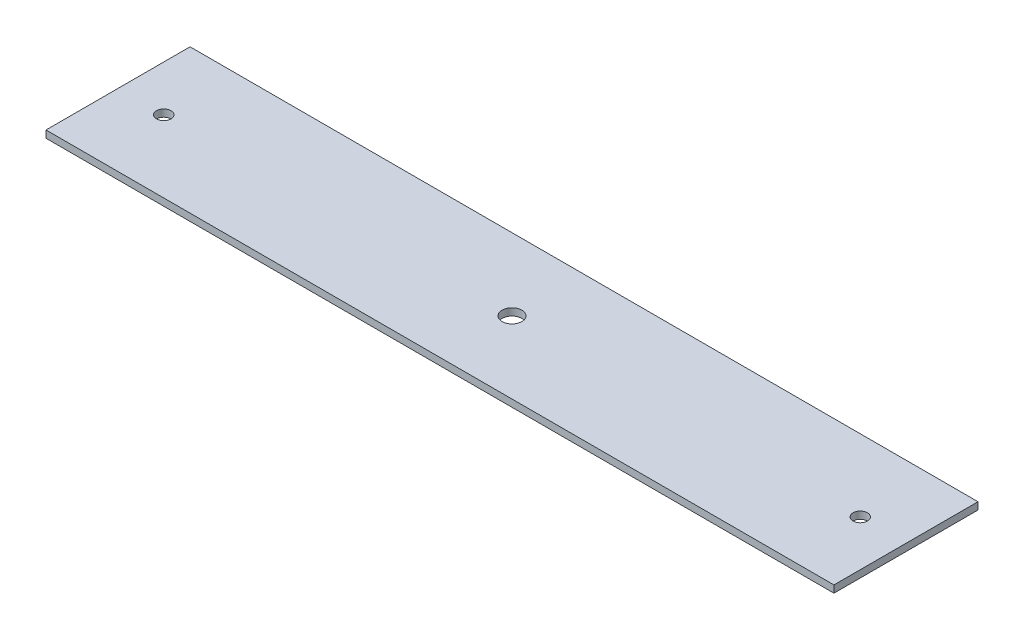
ISO-10303-21;
HEADER;
FILE_DESCRIPTION(('STEP AP214'),'2;1');
FILE_NAME('part.step','',(''),(''),'','','');
FILE_SCHEMA(('AUTOMOTIVE_DESIGN { 1 0 10303 214 1 1 1 1 }'));
ENDSEC;
DATA;
#1=APPLICATION_CONTEXT('core data for automotive mechanical design processes');
#2=APPLICATION_PROTOCOL_DEFINITION('international standard','automotive_design',2000,#1);
#3=PRODUCT_CONTEXT('',#1,'mechanical');
#4=PRODUCT('Part','Part','',(#3));
#5=PRODUCT_RELATED_PRODUCT_CATEGORY('part','',(#4));
#6=PRODUCT_DEFINITION_FORMATION('','',#4);
#7=PRODUCT_DEFINITION_CONTEXT('part definition',#1,'design');
#8=PRODUCT_DEFINITION('design','',#6,#7);
#9=PRODUCT_DEFINITION_SHAPE('','',#8);
#10=(LENGTH_UNIT() NAMED_UNIT(*) SI_UNIT(.MILLI.,.METRE.));
#11=(NAMED_UNIT(*) PLANE_ANGLE_UNIT() SI_UNIT($,.RADIAN.));
#12=(NAMED_UNIT(*) SI_UNIT($,.STERADIAN.) SOLID_ANGLE_UNIT());
#13=UNCERTAINTY_MEASURE_WITH_UNIT(LENGTH_MEASURE(1.E-05),#10,'distance_accuracy_value','');
#14=(GEOMETRIC_REPRESENTATION_CONTEXT(3) GLOBAL_UNCERTAINTY_ASSIGNED_CONTEXT((#13)) GLOBAL_UNIT_ASSIGNED_CONTEXT((#10,
#11,#12)) REPRESENTATION_CONTEXT('',''));
#15=CARTESIAN_POINT('',(0.,0.,0.));
#16=DIRECTION('',(0.,0.,1.));
#17=DIRECTION('',(1.,0.,0.));
#18=AXIS2_PLACEMENT_3D('',#15,#16,#17);
#19=CARTESIAN_POINT('',(0.,4.,0.));
#20=DIRECTION('',(0.,-1.,0.));
#21=DIRECTION('',(0.,0.,-1.));
#22=AXIS2_PLACEMENT_3D('',#19,#20,#21);
#23=PLANE('',#22);
#24=DIRECTION('',(0.,0.,1.));
#25=VECTOR('',#24,1.);
#26=CARTESIAN_POINT('',(-218.8,4.,-40.));
#27=LINE('',#26,#25);
#28=CARTESIAN_POINT('',(-218.8,4.,-40.));
#29=VERTEX_POINT('',#28);
#30=CARTESIAN_POINT('',(-218.8,4.,40.));
#31=VERTEX_POINT('',#30);
#32=EDGE_CURVE('E93',#29,#31,#27,.T.);
#33=ORIENTED_EDGE('',*,*,#32,.T.);
#34=DIRECTION('',(1.,0.,0.));
#35=VECTOR('',#34,1.);
#36=CARTESIAN_POINT('',(218.8,4.,40.));
#37=LINE('',#36,#35);
#38=CARTESIAN_POINT('',(218.8,4.,40.));
#39=VERTEX_POINT('',#38);
#40=EDGE_CURVE('E88',#31,#39,#37,.T.);
#41=ORIENTED_EDGE('',*,*,#40,.T.);
#42=DIRECTION('',(0.,0.,-1.));
#43=VECTOR('',#42,1.);
#44=CARTESIAN_POINT('',(218.8,4.,-40.));
#45=LINE('',#44,#43);
#46=CARTESIAN_POINT('',(218.8,4.,-40.));
#47=VERTEX_POINT('',#46);
#48=EDGE_CURVE('E91',#39,#47,#45,.T.);
#49=ORIENTED_EDGE('',*,*,#48,.T.);
#50=DIRECTION('',(-1.,0.,0.));
#51=VECTOR('',#50,1.);
#52=CARTESIAN_POINT('',(218.8,4.,-40.));
#53=LINE('',#52,#51);
#54=EDGE_CURVE('E58',#47,#29,#53,.T.);
#55=ORIENTED_EDGE('',*,*,#54,.T.);
#56=EDGE_LOOP('',(#33,#41,#49,#55));
#57=FACE_BOUND('',#56,.T.);
#58=CARTESIAN_POINT('',(-1.11022302462516E-13,4.,0.));
#59=DIRECTION('',(0.,1.,0.));
#60=DIRECTION('',(0.,0.,1.));
#61=AXIS2_PLACEMENT_3D('',#58,#59,#60);
#62=CIRCLE('',#61,5.5);
#63=CARTESIAN_POINT('',(-1.11022302462516E-13,4.,5.49999999999998));
#64=VERTEX_POINT('',#63);
#65=EDGE_CURVE('E108',#64,#64,#62,.T.);
#66=ORIENTED_EDGE('',*,*,#65,.F.);
#67=EDGE_LOOP('',(#66));
#68=FACE_BOUND('',#67,.T.);
#69=CARTESIAN_POINT('',(-193.4,4.,0.));
#70=DIRECTION('',(0.,1.,0.));
#71=DIRECTION('',(0.,0.,1.));
#72=AXIS2_PLACEMENT_3D('',#69,#70,#71);
#73=CIRCLE('',#72,3.99999999999999);
#74=CARTESIAN_POINT('',(-193.4,4.,3.99999999999997));
#75=VERTEX_POINT('',#74);
#76=EDGE_CURVE('E123',#75,#75,#73,.T.);
#77=ORIENTED_EDGE('',*,*,#76,.F.);
#78=EDGE_LOOP('',(#77));
#79=FACE_BOUND('',#78,.T.);
#80=CARTESIAN_POINT('',(193.4,4.,0.));
#81=DIRECTION('',(0.,1.,0.));
#82=DIRECTION('',(0.,0.,1.));
#83=AXIS2_PLACEMENT_3D('',#80,#81,#82);
#84=CIRCLE('',#83,3.99999999999999);
#85=CARTESIAN_POINT('',(193.4,4.,3.99999999999999));
#86=VERTEX_POINT('',#85);
#87=EDGE_CURVE('E129',#86,#86,#84,.T.);
#88=ORIENTED_EDGE('',*,*,#87,.F.);
#89=EDGE_LOOP('',(#88));
#90=FACE_BOUND('',#89,.T.);
#91=ADVANCED_FACE('F41',(#57,#68,#79,#90),#23,.F.);
#92=CARTESIAN_POINT('',(0.,0.,0.));
#93=DIRECTION('',(0.,-1.,0.));
#94=DIRECTION('',(0.,0.,-1.));
#95=AXIS2_PLACEMENT_3D('',#92,#93,#94);
#96=PLANE('',#95);
#97=CARTESIAN_POINT('',(-193.4,0.,0.));
#98=DIRECTION('',(0.,1.,0.));
#99=DIRECTION('',(0.,0.,1.));
#100=AXIS2_PLACEMENT_3D('',#97,#98,#99);
#101=CIRCLE('',#100,3.99999999999999);
#102=CARTESIAN_POINT('',(-193.4,0.,3.99999999999997));
#103=VERTEX_POINT('',#102);
#104=EDGE_CURVE('E126',#103,#103,#101,.T.);
#105=ORIENTED_EDGE('',*,*,#104,.T.);
#106=EDGE_LOOP('',(#105));
#107=FACE_BOUND('',#106,.T.);
#108=DIRECTION('',(0.,0.,1.));
#109=VECTOR('',#108,1.);
#110=CARTESIAN_POINT('',(-218.8,0.,-40.));
#111=LINE('',#110,#109);
#112=CARTESIAN_POINT('',(-218.8,0.,-40.));
#113=VERTEX_POINT('',#112);
#114=CARTESIAN_POINT('',(-218.8,0.,40.));
#115=VERTEX_POINT('',#114);
#116=EDGE_CURVE('E105',#113,#115,#111,.T.);
#117=ORIENTED_EDGE('',*,*,#116,.F.);
#118=DIRECTION('',(-1.,0.,0.));
#119=VECTOR('',#118,1.);
#120=CARTESIAN_POINT('',(218.8,0.,-40.));
#121=LINE('',#120,#119);
#122=CARTESIAN_POINT('',(218.8,0.,-40.));
#123=VERTEX_POINT('',#122);
#124=EDGE_CURVE('E81',#123,#113,#121,.T.);
#125=ORIENTED_EDGE('',*,*,#124,.F.);
#126=DIRECTION('',(0.,0.,-1.));
#127=VECTOR('',#126,1.);
#128=CARTESIAN_POINT('',(218.8,0.,-40.));
#129=LINE('',#128,#127);
#130=CARTESIAN_POINT('',(218.8,0.,40.));
#131=VERTEX_POINT('',#130);
#132=EDGE_CURVE('E75',#131,#123,#129,.T.);
#133=ORIENTED_EDGE('',*,*,#132,.F.);
#134=DIRECTION('',(1.,0.,0.));
#135=VECTOR('',#134,1.);
#136=CARTESIAN_POINT('',(218.8,0.,40.));
#137=LINE('',#136,#135);
#138=EDGE_CURVE('E97',#115,#131,#137,.T.);
#139=ORIENTED_EDGE('',*,*,#138,.F.);
#140=EDGE_LOOP('',(#117,#125,#133,#139));
#141=FACE_BOUND('',#140,.T.);
#142=CARTESIAN_POINT('',(-1.11022302462516E-13,0.,0.));
#143=DIRECTION('',(0.,1.,0.));
#144=DIRECTION('',(0.,0.,1.));
#145=AXIS2_PLACEMENT_3D('',#142,#143,#144);
#146=CIRCLE('',#145,5.5);
#147=CARTESIAN_POINT('',(-1.11022302462516E-13,0.,5.49999999999998));
#148=VERTEX_POINT('',#147);
#149=EDGE_CURVE('E120',#148,#148,#146,.T.);
#150=ORIENTED_EDGE('',*,*,#149,.T.);
#151=EDGE_LOOP('',(#150));
#152=FACE_BOUND('',#151,.T.);
#153=CARTESIAN_POINT('',(193.4,0.,0.));
#154=DIRECTION('',(0.,1.,0.));
#155=DIRECTION('',(0.,0.,1.));
#156=AXIS2_PLACEMENT_3D('',#153,#154,#155);
#157=CIRCLE('',#156,3.99999999999999);
#158=CARTESIAN_POINT('',(193.4,0.,3.99999999999999));
#159=VERTEX_POINT('',#158);
#160=EDGE_CURVE('E132',#159,#159,#157,.T.);
#161=ORIENTED_EDGE('',*,*,#160,.T.);
#162=EDGE_LOOP('',(#161));
#163=FACE_BOUND('',#162,.T.);
#164=ADVANCED_FACE('F116',(#107,#141,#152,#163),#96,.T.);
#165=CARTESIAN_POINT('',(-218.8,4.,-40.));
#166=DIRECTION('',(1.,0.,0.));
#167=DIRECTION('',(0.,0.,-1.));
#168=AXIS2_PLACEMENT_3D('',#165,#166,#167);
#169=PLANE('',#168);
#170=ORIENTED_EDGE('',*,*,#116,.T.);
#171=DIRECTION('',(0.,-1.,0.));
#172=VECTOR('',#171,1.);
#173=CARTESIAN_POINT('',(-218.8,4.,40.));
#174=LINE('',#173,#172);
#175=EDGE_CURVE('E11',#31,#115,#174,.T.);
#176=ORIENTED_EDGE('',*,*,#175,.F.);
#177=ORIENTED_EDGE('',*,*,#32,.F.);
#178=DIRECTION('',(0.,-1.,0.));
#179=VECTOR('',#178,1.);
#180=CARTESIAN_POINT('',(-218.8,4.,-40.));
#181=LINE('',#180,#179);
#182=EDGE_CURVE('E101',#29,#113,#181,.T.);
#183=ORIENTED_EDGE('',*,*,#182,.T.);
#184=EDGE_LOOP('',(#170,#176,#177,#183));
#185=FACE_BOUND('',#184,.T.);
#186=ADVANCED_FACE('F43',(#185),#169,.F.);
#187=CARTESIAN_POINT('',(218.8,4.,40.));
#188=DIRECTION('',(0.,0.,-1.));
#189=DIRECTION('',(-1.,0.,0.));
#190=AXIS2_PLACEMENT_3D('',#187,#188,#189);
#191=PLANE('',#190);
#192=ORIENTED_EDGE('',*,*,#138,.T.);
#193=DIRECTION('',(0.,-1.,0.));
#194=VECTOR('',#193,1.);
#195=CARTESIAN_POINT('',(218.8,4.,40.));
#196=LINE('',#195,#194);
#197=EDGE_CURVE('E50',#39,#131,#196,.T.);
#198=ORIENTED_EDGE('',*,*,#197,.F.);
#199=ORIENTED_EDGE('',*,*,#40,.F.);
#200=ORIENTED_EDGE('',*,*,#175,.T.);
#201=EDGE_LOOP('',(#192,#198,#199,#200));
#202=FACE_BOUND('',#201,.T.);
#203=ADVANCED_FACE('F96',(#202),#191,.F.);
#204=CARTESIAN_POINT('',(218.8,4.,-40.));
#205=DIRECTION('',(-1.,0.,0.));
#206=DIRECTION('',(0.,0.,1.));
#207=AXIS2_PLACEMENT_3D('',#204,#205,#206);
#208=PLANE('',#207);
#209=ORIENTED_EDGE('',*,*,#132,.T.);
#210=DIRECTION('',(0.,-1.,0.));
#211=VECTOR('',#210,1.);
#212=CARTESIAN_POINT('',(218.8,4.,-40.));
#213=LINE('',#212,#211);
#214=EDGE_CURVE('E98',#47,#123,#213,.T.);
#215=ORIENTED_EDGE('',*,*,#214,.F.);
#216=ORIENTED_EDGE('',*,*,#48,.F.);
#217=ORIENTED_EDGE('',*,*,#197,.T.);
#218=EDGE_LOOP('',(#209,#215,#216,#217));
#219=FACE_BOUND('',#218,.T.);
#220=ADVANCED_FACE('F99',(#219),#208,.F.);
#221=CARTESIAN_POINT('',(218.8,4.,-40.));
#222=DIRECTION('',(0.,0.,1.));
#223=DIRECTION('',(1.,0.,0.));
#224=AXIS2_PLACEMENT_3D('',#221,#222,#223);
#225=PLANE('',#224);
#226=ORIENTED_EDGE('',*,*,#124,.T.);
#227=ORIENTED_EDGE('',*,*,#182,.F.);
#228=ORIENTED_EDGE('',*,*,#54,.F.);
#229=ORIENTED_EDGE('',*,*,#214,.T.);
#230=EDGE_LOOP('',(#226,#227,#228,#229));
#231=FACE_BOUND('',#230,.T.);
#232=ADVANCED_FACE('F113',(#231),#225,.F.);
#233=CARTESIAN_POINT('',(-1.11022302462516E-13,4.,0.));
#234=DIRECTION('',(0.,-1.,0.));
#235=DIRECTION('',(0.,0.,-1.));
#236=AXIS2_PLACEMENT_3D('',#233,#234,#235);
#237=CYLINDRICAL_SURFACE('',#236,5.5);
#238=ORIENTED_EDGE('',*,*,#65,.T.);
#239=EDGE_LOOP('',(#238));
#240=FACE_BOUND('',#239,.T.);
#241=ORIENTED_EDGE('',*,*,#149,.F.);
#242=EDGE_LOOP('',(#241));
#243=FACE_BOUND('',#242,.T.);
#244=ADVANCED_FACE('F149',(#240,#243),#237,.F.);
#245=CARTESIAN_POINT('',(-193.4,4.,0.));
#246=DIRECTION('',(0.,-1.,0.));
#247=DIRECTION('',(0.,0.,-1.));
#248=AXIS2_PLACEMENT_3D('',#245,#246,#247);
#249=CYLINDRICAL_SURFACE('',#248,3.99999999999999);
#250=ORIENTED_EDGE('',*,*,#76,.T.);
#251=EDGE_LOOP('',(#250));
#252=FACE_BOUND('',#251,.T.);
#253=ORIENTED_EDGE('',*,*,#104,.F.);
#254=EDGE_LOOP('',(#253));
#255=FACE_BOUND('',#254,.T.);
#256=ADVANCED_FACE('F194',(#252,#255),#249,.F.);
#257=CARTESIAN_POINT('',(193.4,4.,0.));
#258=DIRECTION('',(0.,-1.,0.));
#259=DIRECTION('',(0.,0.,-1.));
#260=AXIS2_PLACEMENT_3D('',#257,#258,#259);
#261=CYLINDRICAL_SURFACE('',#260,3.99999999999999);
#262=ORIENTED_EDGE('',*,*,#87,.T.);
#263=EDGE_LOOP('',(#262));
#264=FACE_BOUND('',#263,.T.);
#265=ORIENTED_EDGE('',*,*,#160,.F.);
#266=EDGE_LOOP('',(#265));
#267=FACE_BOUND('',#266,.T.);
#268=ADVANCED_FACE('F138',(#264,#267),#261,.F.);
#269=CLOSED_SHELL('',(#91,#164,#186,#203,#220,#232,#244,#256,#268));
#270=MANIFOLD_SOLID_BREP('B2',#269);
#271=ADVANCED_BREP_SHAPE_REPRESENTATION('',(#18,#270),#14);
#272=SHAPE_DEFINITION_REPRESENTATION(#9,#271);
ENDSEC;
END-ISO-10303-21;
